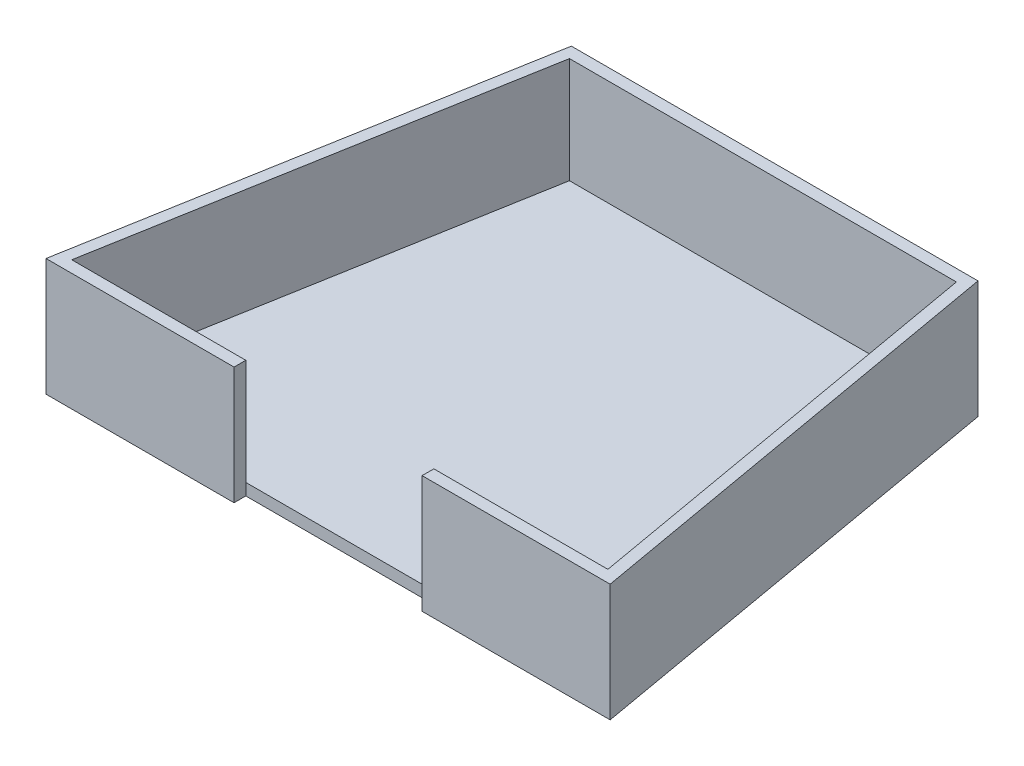
ISO-10303-21;
HEADER;
FILE_DESCRIPTION(('STEP AP214'),'2;1');
FILE_NAME('part.step','',(''),(''),'','','');
FILE_SCHEMA(('AUTOMOTIVE_DESIGN { 1 0 10303 214 1 1 1 1 }'));
ENDSEC;
DATA;
#1=APPLICATION_CONTEXT('core data for automotive mechanical design processes');
#2=APPLICATION_PROTOCOL_DEFINITION('international standard','automotive_design',2000,#1);
#3=PRODUCT_CONTEXT('',#1,'mechanical');
#4=PRODUCT('Part','Part','',(#3));
#5=PRODUCT_RELATED_PRODUCT_CATEGORY('part','',(#4));
#6=PRODUCT_DEFINITION_FORMATION('','',#4);
#7=PRODUCT_DEFINITION_CONTEXT('part definition',#1,'design');
#8=PRODUCT_DEFINITION('design','',#6,#7);
#9=PRODUCT_DEFINITION_SHAPE('','',#8);
#10=(LENGTH_UNIT() NAMED_UNIT(*) SI_UNIT(.MILLI.,.METRE.));
#11=(NAMED_UNIT(*) PLANE_ANGLE_UNIT() SI_UNIT($,.RADIAN.));
#12=(NAMED_UNIT(*) SI_UNIT($,.STERADIAN.) SOLID_ANGLE_UNIT());
#13=UNCERTAINTY_MEASURE_WITH_UNIT(LENGTH_MEASURE(1.E-05),#10,'distance_accuracy_value','');
#14=(GEOMETRIC_REPRESENTATION_CONTEXT(3) GLOBAL_UNCERTAINTY_ASSIGNED_CONTEXT((#13)) GLOBAL_UNIT_ASSIGNED_CONTEXT((#10,
#11,#12)) REPRESENTATION_CONTEXT('',''));
#15=CARTESIAN_POINT('',(0.,0.,0.));
#16=DIRECTION('',(0.,0.,1.));
#17=DIRECTION('',(1.,0.,0.));
#18=AXIS2_PLACEMENT_3D('',#15,#16,#17);
#19=CARTESIAN_POINT('',(240.,50.,0.));
#20=DIRECTION('',(0.,0.,-1.));
#21=DIRECTION('',(-1.,0.,0.));
#22=AXIS2_PLACEMENT_3D('',#19,#20,#21);
#23=PLANE('',#22);
#24=DIRECTION('',(0.,-1.,0.));
#25=VECTOR('',#24,1.);
#26=CARTESIAN_POINT('',(160.,0.,0.));
#27=LINE('',#26,#25);
#28=CARTESIAN_POINT('',(160.,50.,0.));
#29=VERTEX_POINT('',#28);
#30=CARTESIAN_POINT('',(160.,0.,0.));
#31=VERTEX_POINT('',#30);
#32=EDGE_CURVE('E282',#29,#31,#27,.T.);
#33=ORIENTED_EDGE('',*,*,#32,.T.);
#34=DIRECTION('',(1.,0.,0.));
#35=VECTOR('',#34,1.);
#36=CARTESIAN_POINT('',(240.,0.,0.));
#37=LINE('',#36,#35);
#38=CARTESIAN_POINT('',(240.,0.,0.));
#39=VERTEX_POINT('',#38);
#40=EDGE_CURVE('E164',#31,#39,#37,.T.);
#41=ORIENTED_EDGE('',*,*,#40,.T.);
#42=DIRECTION('',(0.,-1.,0.));
#43=VECTOR('',#42,1.);
#44=CARTESIAN_POINT('',(240.,50.,0.));
#45=LINE('',#44,#43);
#46=CARTESIAN_POINT('',(240.,50.,0.));
#47=VERTEX_POINT('',#46);
#48=EDGE_CURVE('E11',#47,#39,#45,.T.);
#49=ORIENTED_EDGE('',*,*,#48,.F.);
#50=DIRECTION('',(1.,0.,0.));
#51=VECTOR('',#50,1.);
#52=CARTESIAN_POINT('',(240.,50.,0.));
#53=LINE('',#52,#51);
#54=EDGE_CURVE('E226',#29,#47,#53,.T.);
#55=ORIENTED_EDGE('',*,*,#54,.F.);
#56=EDGE_LOOP('',(#33,#41,#49,#55));
#57=FACE_BOUND('',#56,.T.);
#58=ADVANCED_FACE('F46',(#57),#23,.F.);
#59=CARTESIAN_POINT('',(240.,50.,-5.00000000000002));
#60=DIRECTION('',(0.,0.,-1.));
#61=DIRECTION('',(-1.,0.,0.));
#62=AXIS2_PLACEMENT_3D('',#59,#60,#61);
#63=PLANE('',#62);
#64=DIRECTION('',(1.,0.,0.));
#65=VECTOR('',#64,1.);
#66=CARTESIAN_POINT('',(0.,5.,-5.));
#67=LINE('',#66,#65);
#68=CARTESIAN_POINT('',(160.,5.,-5.00000000000001));
#69=VERTEX_POINT('',#68);
#70=CARTESIAN_POINT('',(234.041232037029,5.,-5.00000000000002));
#71=VERTEX_POINT('',#70);
#72=EDGE_CURVE('E184',#69,#71,#67,.T.);
#73=ORIENTED_EDGE('',*,*,#72,.F.);
#74=DIRECTION('',(0.,-1.,0.));
#75=VECTOR('',#74,1.);
#76=CARTESIAN_POINT('',(160.,0.,-5.));
#77=LINE('',#76,#75);
#78=CARTESIAN_POINT('',(160.,50.,-5.));
#79=VERTEX_POINT('',#78);
#80=EDGE_CURVE('E62',#79,#69,#77,.T.);
#81=ORIENTED_EDGE('',*,*,#80,.F.);
#82=DIRECTION('',(1.,0.,0.));
#83=VECTOR('',#82,1.);
#84=CARTESIAN_POINT('',(0.,50.,-5.));
#85=LINE('',#84,#83);
#86=CARTESIAN_POINT('',(234.041232037029,50.,-5.00000000000002));
#87=VERTEX_POINT('',#86);
#88=EDGE_CURVE('E208',#79,#87,#85,.T.);
#89=ORIENTED_EDGE('',*,*,#88,.T.);
#90=DIRECTION('',(0.,-1.,0.));
#91=VECTOR('',#90,1.);
#92=CARTESIAN_POINT('',(234.041232037029,50.,-5.));
#93=LINE('',#92,#91);
#94=EDGE_CURVE('E185',#87,#71,#93,.T.);
#95=ORIENTED_EDGE('',*,*,#94,.T.);
#96=EDGE_LOOP('',(#73,#81,#89,#95));
#97=FACE_BOUND('',#96,.T.);
#98=ADVANCED_FACE('F320',(#97),#63,.T.);
#99=CARTESIAN_POINT('',(0.,50.,0.));
#100=DIRECTION('',(0.,-1.,0.));
#101=DIRECTION('',(0.,0.,-1.));
#102=AXIS2_PLACEMENT_3D('',#99,#100,#101);
#103=PLANE('',#102);
#104=CARTESIAN_POINT('',(0.,50.,0.));
#105=VERTEX_POINT('',#104);
#106=CARTESIAN_POINT('',(80.,50.,0.));
#107=VERTEX_POINT('',#106);
#108=EDGE_CURVE('E221',#105,#107,#53,.T.);
#109=ORIENTED_EDGE('',*,*,#108,.T.);
#110=DIRECTION('',(0.,0.,1.));
#111=VECTOR('',#110,1.);
#112=CARTESIAN_POINT('',(80.,50.,-5.));
#113=LINE('',#112,#111);
#114=CARTESIAN_POINT('',(80.,50.,-5.));
#115=VERTEX_POINT('',#114);
#116=EDGE_CURVE('E172',#115,#107,#113,.T.);
#117=ORIENTED_EDGE('',*,*,#116,.F.);
#118=CARTESIAN_POINT('',(5.95876796297107,50.,-5.));
#119=VERTEX_POINT('',#118);
#120=EDGE_CURVE('E209',#119,#115,#85,.T.);
#121=ORIENTED_EDGE('',*,*,#120,.F.);
#122=DIRECTION('',(-0.173648177666934,0.,0.984807753012208));
#123=VECTOR('',#122,1.);
#124=CARTESIAN_POINT('',(4.92403876506104,50.,0.868240888334671));
#125=LINE('',#124,#123);
#126=CARTESIAN_POINT('',(37.6976244904955,50.,-185.));
#127=VERTEX_POINT('',#126);
#128=EDGE_CURVE('E194',#127,#119,#125,.T.);
#129=ORIENTED_EDGE('',*,*,#128,.F.);
#130=DIRECTION('',(-1.,0.,0.));
#131=VECTOR('',#130,1.);
#132=CARTESIAN_POINT('',(0.,50.,-185.));
#133=LINE('',#132,#131);
#134=CARTESIAN_POINT('',(202.302375509504,50.,-185.));
#135=VERTEX_POINT('',#134);
#136=EDGE_CURVE('E216',#135,#127,#133,.T.);
#137=ORIENTED_EDGE('',*,*,#136,.F.);
#138=DIRECTION('',(-0.173648177666935,0.,-0.984807753012207));
#139=VECTOR('',#138,1.);
#140=CARTESIAN_POINT('',(227.839075729248,50.,-40.1741763107466));
#141=LINE('',#140,#139);
#142=EDGE_CURVE('E213',#87,#135,#141,.T.);
#143=ORIENTED_EDGE('',*,*,#142,.F.);
#144=ORIENTED_EDGE('',*,*,#88,.F.);
#145=DIRECTION('',(0.,0.,1.));
#146=VECTOR('',#145,1.);
#147=CARTESIAN_POINT('',(160.,50.,-5.));
#148=LINE('',#147,#146);
#149=EDGE_CURVE('E166',#79,#29,#148,.T.);
#150=ORIENTED_EDGE('',*,*,#149,.T.);
#151=ORIENTED_EDGE('',*,*,#54,.T.);
#152=DIRECTION('',(-0.173648177666935,0.,-0.984807753012207));
#153=VECTOR('',#152,1.);
#154=CARTESIAN_POINT('',(206.497873665391,50.,-190.));
#155=LINE('',#154,#153);
#156=CARTESIAN_POINT('',(206.497873665391,50.,-190.));
#157=VERTEX_POINT('',#156);
#158=EDGE_CURVE('E225',#47,#157,#155,.T.);
#159=ORIENTED_EDGE('',*,*,#158,.T.);
#160=DIRECTION('',(-1.,0.,0.));
#161=VECTOR('',#160,1.);
#162=CARTESIAN_POINT('',(33.5021263346091,50.,-190.));
#163=LINE('',#162,#161);
#164=CARTESIAN_POINT('',(33.5021263346091,50.,-190.));
#165=VERTEX_POINT('',#164);
#166=EDGE_CURVE('E229',#157,#165,#163,.T.);
#167=ORIENTED_EDGE('',*,*,#166,.T.);
#168=DIRECTION('',(-0.173648177666934,0.,0.984807753012207));
#169=VECTOR('',#168,1.);
#170=CARTESIAN_POINT('',(0.,50.,0.));
#171=LINE('',#170,#169);
#172=EDGE_CURVE('E232',#165,#105,#171,.T.);
#173=ORIENTED_EDGE('',*,*,#172,.T.);
#174=EDGE_LOOP('',(#109,#117,#121,#129,#137,#143,#144,#150,#151,#159,#167,#173));
#175=FACE_BOUND('',#174,.T.);
#176=ADVANCED_FACE('F276',(#175),#103,.F.);
#177=CARTESIAN_POINT('',(0.,0.,0.));
#178=VERTEX_POINT('',#177);
#179=CARTESIAN_POINT('',(80.,0.,0.));
#180=VERTEX_POINT('',#179);
#181=EDGE_CURVE('E236',#178,#180,#37,.T.);
#182=ORIENTED_EDGE('',*,*,#181,.T.);
#183=DIRECTION('',(0.,-1.,0.));
#184=VECTOR('',#183,1.);
#185=CARTESIAN_POINT('',(80.,0.,0.));
#186=LINE('',#185,#184);
#187=EDGE_CURVE('E159',#107,#180,#186,.T.);
#188=ORIENTED_EDGE('',*,*,#187,.F.);
#189=ORIENTED_EDGE('',*,*,#108,.F.);
#190=DIRECTION('',(0.,-1.,0.));
#191=VECTOR('',#190,1.);
#192=CARTESIAN_POINT('',(0.,50.,0.));
#193=LINE('',#192,#191);
#194=EDGE_CURVE('E235',#105,#178,#193,.T.);
#195=ORIENTED_EDGE('',*,*,#194,.T.);
#196=EDGE_LOOP('',(#182,#188,#189,#195));
#197=FACE_BOUND('',#196,.T.);
#198=ADVANCED_FACE('F48',(#197),#23,.F.);
#199=CARTESIAN_POINT('',(206.497873665391,50.,-190.));
#200=DIRECTION('',(-0.984807753012207,0.,0.173648177666935));
#201=DIRECTION('',(0.173648177666935,0.,0.984807753012207));
#202=AXIS2_PLACEMENT_3D('',#199,#200,#201);
#203=PLANE('',#202);
#204=DIRECTION('',(-0.173648177666935,0.,-0.984807753012207));
#205=VECTOR('',#204,1.);
#206=CARTESIAN_POINT('',(206.497873665391,0.,-190.));
#207=LINE('',#206,#205);
#208=CARTESIAN_POINT('',(206.497873665391,0.,-190.));
#209=VERTEX_POINT('',#208);
#210=EDGE_CURVE('E240',#39,#209,#207,.T.);
#211=ORIENTED_EDGE('',*,*,#210,.T.);
#212=DIRECTION('',(0.,-1.,0.));
#213=VECTOR('',#212,1.);
#214=CARTESIAN_POINT('',(206.497873665391,50.,-190.));
#215=LINE('',#214,#213);
#216=EDGE_CURVE('E55',#157,#209,#215,.T.);
#217=ORIENTED_EDGE('',*,*,#216,.F.);
#218=ORIENTED_EDGE('',*,*,#158,.F.);
#219=ORIENTED_EDGE('',*,*,#48,.T.);
#220=EDGE_LOOP('',(#211,#217,#218,#219));
#221=FACE_BOUND('',#220,.T.);
#222=ADVANCED_FACE('F280',(#221),#203,.F.);
#223=CARTESIAN_POINT('',(33.5021263346091,50.,-190.));
#224=DIRECTION('',(0.,0.,1.));
#225=DIRECTION('',(1.,0.,0.));
#226=AXIS2_PLACEMENT_3D('',#223,#224,#225);
#227=PLANE('',#226);
#228=DIRECTION('',(-1.,0.,0.));
#229=VECTOR('',#228,1.);
#230=CARTESIAN_POINT('',(33.5021263346091,0.,-190.));
#231=LINE('',#230,#229);
#232=CARTESIAN_POINT('',(33.5021263346091,0.,-190.));
#233=VERTEX_POINT('',#232);
#234=EDGE_CURVE('E243',#209,#233,#231,.T.);
#235=ORIENTED_EDGE('',*,*,#234,.T.);
#236=DIRECTION('',(0.,-1.,0.));
#237=VECTOR('',#236,1.);
#238=CARTESIAN_POINT('',(33.5021263346091,50.,-190.));
#239=LINE('',#238,#237);
#240=EDGE_CURVE('E252',#165,#233,#239,.T.);
#241=ORIENTED_EDGE('',*,*,#240,.F.);
#242=ORIENTED_EDGE('',*,*,#166,.F.);
#243=ORIENTED_EDGE('',*,*,#216,.T.);
#244=EDGE_LOOP('',(#235,#241,#242,#243));
#245=FACE_BOUND('',#244,.T.);
#246=ADVANCED_FACE('F261',(#245),#227,.F.);
#247=CARTESIAN_POINT('',(0.,50.,0.));
#248=DIRECTION('',(0.984807753012207,0.,0.173648177666934));
#249=DIRECTION('',(0.173648177666934,0.,-0.984807753012208));
#250=AXIS2_PLACEMENT_3D('',#247,#248,#249);
#251=PLANE('',#250);
#252=DIRECTION('',(-0.173648177666934,0.,0.984807753012207));
#253=VECTOR('',#252,1.);
#254=CARTESIAN_POINT('',(0.,0.,0.));
#255=LINE('',#254,#253);
#256=EDGE_CURVE('E246',#233,#178,#255,.T.);
#257=ORIENTED_EDGE('',*,*,#256,.T.);
#258=ORIENTED_EDGE('',*,*,#194,.F.);
#259=ORIENTED_EDGE('',*,*,#172,.F.);
#260=ORIENTED_EDGE('',*,*,#240,.T.);
#261=EDGE_LOOP('',(#257,#258,#259,#260));
#262=FACE_BOUND('',#261,.T.);
#263=ADVANCED_FACE('F269',(#262),#251,.F.);
#264=CARTESIAN_POINT('',(0.,0.,0.));
#265=DIRECTION('',(0.,-1.,0.));
#266=DIRECTION('',(0.,0.,-1.));
#267=AXIS2_PLACEMENT_3D('',#264,#265,#266);
#268=PLANE('',#267);
#269=DIRECTION('',(0.,0.,1.));
#270=VECTOR('',#269,1.);
#271=CARTESIAN_POINT('',(80.,0.,-5.));
#272=LINE('',#271,#270);
#273=CARTESIAN_POINT('',(80.,0.,-5.));
#274=VERTEX_POINT('',#273);
#275=EDGE_CURVE('E289',#274,#180,#272,.T.);
#276=ORIENTED_EDGE('',*,*,#275,.T.);
#277=ORIENTED_EDGE('',*,*,#181,.F.);
#278=ORIENTED_EDGE('',*,*,#256,.F.);
#279=ORIENTED_EDGE('',*,*,#234,.F.);
#280=ORIENTED_EDGE('',*,*,#210,.F.);
#281=ORIENTED_EDGE('',*,*,#40,.F.);
#282=DIRECTION('',(0.,0.,1.));
#283=VECTOR('',#282,1.);
#284=CARTESIAN_POINT('',(160.,0.,-5.));
#285=LINE('',#284,#283);
#286=CARTESIAN_POINT('',(160.,0.,-5.));
#287=VERTEX_POINT('',#286);
#288=EDGE_CURVE('E144',#287,#31,#285,.T.);
#289=ORIENTED_EDGE('',*,*,#288,.F.);
#290=DIRECTION('',(1.,0.,0.));
#291=VECTOR('',#290,1.);
#292=CARTESIAN_POINT('',(0.,0.,-5.));
#293=LINE('',#292,#291);
#294=EDGE_CURVE('E149',#274,#287,#293,.T.);
#295=ORIENTED_EDGE('',*,*,#294,.F.);
#296=EDGE_LOOP('',(#276,#277,#278,#279,#280,#281,#289,#295));
#297=FACE_BOUND('',#296,.T.);
#298=ADVANCED_FACE('F162',(#297),#268,.T.);
#299=DIRECTION('',(0.,-1.,0.));
#300=VECTOR('',#299,1.);
#301=CARTESIAN_POINT('',(80.,0.,-5.));
#302=LINE('',#301,#300);
#303=CARTESIAN_POINT('',(80.,5.,-5.));
#304=VERTEX_POINT('',#303);
#305=EDGE_CURVE('E167',#115,#304,#302,.T.);
#306=ORIENTED_EDGE('',*,*,#305,.T.);
#307=CARTESIAN_POINT('',(5.95876796297107,5.,-5.));
#308=VERTEX_POINT('',#307);
#309=EDGE_CURVE('E178',#308,#304,#67,.T.);
#310=ORIENTED_EDGE('',*,*,#309,.F.);
#311=DIRECTION('',(0.,-1.,0.));
#312=VECTOR('',#311,1.);
#313=CARTESIAN_POINT('',(5.9587679629711,50.,-5.));
#314=LINE('',#313,#312);
#315=EDGE_CURVE('E190',#119,#308,#314,.T.);
#316=ORIENTED_EDGE('',*,*,#315,.F.);
#317=ORIENTED_EDGE('',*,*,#120,.T.);
#318=EDGE_LOOP('',(#306,#310,#316,#317));
#319=FACE_BOUND('',#318,.T.);
#320=ADVANCED_FACE('F302',(#319),#63,.T.);
#321=CARTESIAN_POINT('',(201.57383490033,50.,-189.131759111665));
#322=DIRECTION('',(-0.984807753012207,0.,0.173648177666935));
#323=DIRECTION('',(0.173648177666935,0.,0.984807753012207));
#324=AXIS2_PLACEMENT_3D('',#321,#322,#323);
#325=PLANE('',#324);
#326=DIRECTION('',(-0.173648177666935,0.,-0.984807753012207));
#327=VECTOR('',#326,1.);
#328=CARTESIAN_POINT('',(227.839075729248,5.,-40.1741763107466));
#329=LINE('',#328,#327);
#330=CARTESIAN_POINT('',(202.302375509504,5.,-185.));
#331=VERTEX_POINT('',#330);
#332=EDGE_CURVE('E182',#71,#331,#329,.T.);
#333=ORIENTED_EDGE('',*,*,#332,.F.);
#334=ORIENTED_EDGE('',*,*,#94,.F.);
#335=ORIENTED_EDGE('',*,*,#142,.T.);
#336=DIRECTION('',(0.,-1.,0.));
#337=VECTOR('',#336,1.);
#338=CARTESIAN_POINT('',(202.302375509504,50.,-185.));
#339=LINE('',#338,#337);
#340=EDGE_CURVE('E189',#135,#331,#339,.T.);
#341=ORIENTED_EDGE('',*,*,#340,.T.);
#342=EDGE_LOOP('',(#333,#334,#335,#341));
#343=FACE_BOUND('',#342,.T.);
#344=ADVANCED_FACE('F317',(#343),#325,.T.);
#345=CARTESIAN_POINT('',(33.5021263346091,50.,-185.));
#346=DIRECTION('',(0.,0.,1.));
#347=DIRECTION('',(1.,0.,0.));
#348=AXIS2_PLACEMENT_3D('',#345,#346,#347);
#349=PLANE('',#348);
#350=DIRECTION('',(-1.,0.,0.));
#351=VECTOR('',#350,1.);
#352=CARTESIAN_POINT('',(0.,5.,-185.));
#353=LINE('',#352,#351);
#354=CARTESIAN_POINT('',(37.6976244904955,5.,-185.));
#355=VERTEX_POINT('',#354);
#356=EDGE_CURVE('E197',#331,#355,#353,.T.);
#357=ORIENTED_EDGE('',*,*,#356,.F.);
#358=ORIENTED_EDGE('',*,*,#340,.F.);
#359=ORIENTED_EDGE('',*,*,#136,.T.);
#360=DIRECTION('',(0.,-1.,0.));
#361=VECTOR('',#360,1.);
#362=CARTESIAN_POINT('',(37.6976244904955,50.,-185.));
#363=LINE('',#362,#361);
#364=EDGE_CURVE('E70',#127,#355,#363,.T.);
#365=ORIENTED_EDGE('',*,*,#364,.T.);
#366=EDGE_LOOP('',(#357,#358,#359,#365));
#367=FACE_BOUND('',#366,.T.);
#368=ADVANCED_FACE('F314',(#367),#349,.T.);
#369=CARTESIAN_POINT('',(4.92403876506104,50.,0.868240888334671));
#370=DIRECTION('',(0.984807753012207,0.,0.173648177666934));
#371=DIRECTION('',(0.173648177666934,0.,-0.984807753012208));
#372=AXIS2_PLACEMENT_3D('',#369,#370,#371);
#373=PLANE('',#372);
#374=DIRECTION('',(-0.173648177666934,0.,0.984807753012208));
#375=VECTOR('',#374,1.);
#376=CARTESIAN_POINT('',(4.92403876506104,5.,0.868240888334671));
#377=LINE('',#376,#375);
#378=EDGE_CURVE('E203',#355,#308,#377,.T.);
#379=ORIENTED_EDGE('',*,*,#378,.F.);
#380=ORIENTED_EDGE('',*,*,#364,.F.);
#381=ORIENTED_EDGE('',*,*,#128,.T.);
#382=ORIENTED_EDGE('',*,*,#315,.T.);
#383=EDGE_LOOP('',(#379,#380,#381,#382));
#384=FACE_BOUND('',#383,.T.);
#385=ADVANCED_FACE('F307',(#384),#373,.T.);
#386=CARTESIAN_POINT('',(0.,5.,0.));
#387=DIRECTION('',(0.,-1.,0.));
#388=DIRECTION('',(0.,0.,-1.));
#389=AXIS2_PLACEMENT_3D('',#386,#387,#388);
#390=PLANE('',#389);
#391=ORIENTED_EDGE('',*,*,#309,.T.);
#392=EDGE_CURVE('E183',#304,#69,#67,.T.);
#393=ORIENTED_EDGE('',*,*,#392,.T.);
#394=ORIENTED_EDGE('',*,*,#72,.T.);
#395=ORIENTED_EDGE('',*,*,#332,.T.);
#396=ORIENTED_EDGE('',*,*,#356,.T.);
#397=ORIENTED_EDGE('',*,*,#378,.T.);
#398=EDGE_LOOP('',(#391,#393,#394,#395,#396,#397));
#399=FACE_BOUND('',#398,.T.);
#400=ADVANCED_FACE('F305',(#399),#390,.F.);
#401=CARTESIAN_POINT('',(0.,0.,-5.));
#402=DIRECTION('',(0.,0.,1.));
#403=DIRECTION('',(1.,0.,0.));
#404=AXIS2_PLACEMENT_3D('',#401,#402,#403);
#405=PLANE('',#404);
#406=ORIENTED_EDGE('',*,*,#392,.F.);
#407=EDGE_CURVE('E154',#304,#274,#302,.T.);
#408=ORIENTED_EDGE('',*,*,#407,.T.);
#409=ORIENTED_EDGE('',*,*,#294,.T.);
#410=EDGE_CURVE('E140',#69,#287,#77,.T.);
#411=ORIENTED_EDGE('',*,*,#410,.F.);
#412=EDGE_LOOP('',(#406,#408,#409,#411));
#413=FACE_BOUND('',#412,.T.);
#414=ADVANCED_FACE('F152',(#413),#405,.T.);
#415=CARTESIAN_POINT('',(80.,0.,-5.));
#416=DIRECTION('',(-1.,0.,0.));
#417=DIRECTION('',(0.,0.,1.));
#418=AXIS2_PLACEMENT_3D('',#415,#416,#417);
#419=PLANE('',#418);
#420=ORIENTED_EDGE('',*,*,#187,.T.);
#421=ORIENTED_EDGE('',*,*,#275,.F.);
#422=ORIENTED_EDGE('',*,*,#407,.F.);
#423=ORIENTED_EDGE('',*,*,#305,.F.);
#424=ORIENTED_EDGE('',*,*,#116,.T.);
#425=EDGE_LOOP('',(#420,#421,#422,#423,#424));
#426=FACE_BOUND('',#425,.T.);
#427=ADVANCED_FACE('F299',(#426),#419,.F.);
#428=CARTESIAN_POINT('',(160.,0.,-5.));
#429=DIRECTION('',(-1.,0.,0.));
#430=DIRECTION('',(0.,0.,1.));
#431=AXIS2_PLACEMENT_3D('',#428,#429,#430);
#432=PLANE('',#431);
#433=ORIENTED_EDGE('',*,*,#32,.F.);
#434=ORIENTED_EDGE('',*,*,#149,.F.);
#435=ORIENTED_EDGE('',*,*,#80,.T.);
#436=ORIENTED_EDGE('',*,*,#410,.T.);
#437=ORIENTED_EDGE('',*,*,#288,.T.);
#438=EDGE_LOOP('',(#433,#434,#435,#436,#437));
#439=FACE_BOUND('',#438,.T.);
#440=ADVANCED_FACE('F142',(#439),#432,.T.);
#441=CLOSED_SHELL('',(#58,#98,#176,#198,#222,#246,#263,#298,#320,#344,#368,#385,#400,#414,#427,#440));
#442=MANIFOLD_SOLID_BREP('B2',#441);
#443=ADVANCED_BREP_SHAPE_REPRESENTATION('',(#18,#442),#14);
#444=SHAPE_DEFINITION_REPRESENTATION(#9,#443);
ENDSEC;
END-ISO-10303-21;
